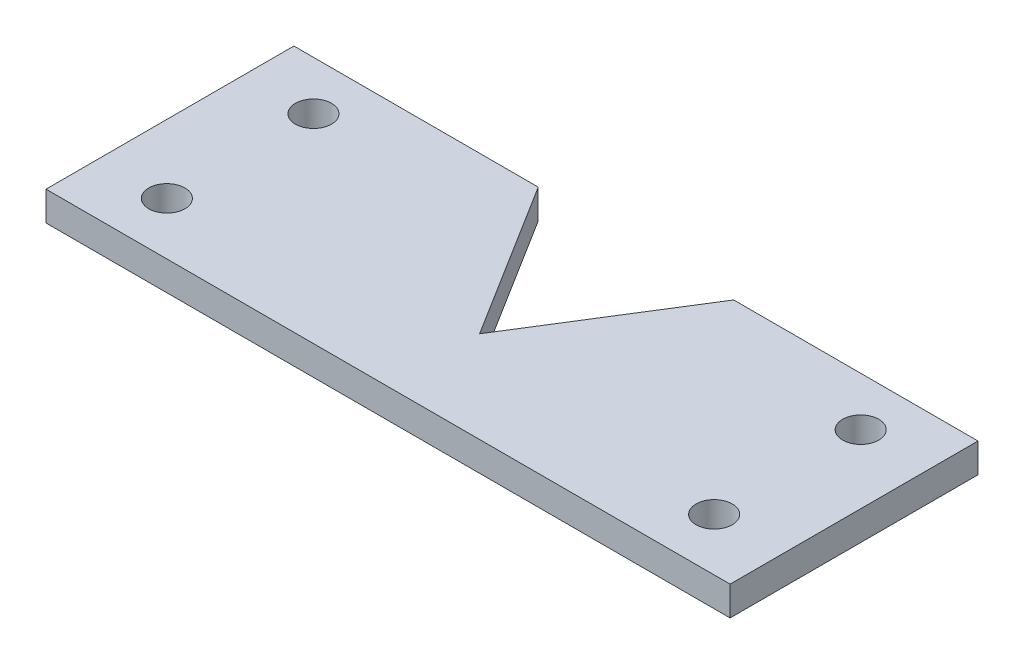
ISO-10303-21;
HEADER;
FILE_DESCRIPTION(('STEP AP214'),'2;1');
FILE_NAME('part.step','',(''),(''),'','','');
FILE_SCHEMA(('AUTOMOTIVE_DESIGN { 1 0 10303 214 1 1 1 1 }'));
ENDSEC;
DATA;
#1=APPLICATION_CONTEXT('core data for automotive mechanical design processes');
#2=APPLICATION_PROTOCOL_DEFINITION('international standard','automotive_design',2000,#1);
#3=PRODUCT_CONTEXT('',#1,'mechanical');
#4=PRODUCT('Part','Part','',(#3));
#5=PRODUCT_RELATED_PRODUCT_CATEGORY('part','',(#4));
#6=PRODUCT_DEFINITION_FORMATION('','',#4);
#7=PRODUCT_DEFINITION_CONTEXT('part definition',#1,'design');
#8=PRODUCT_DEFINITION('design','',#6,#7);
#9=PRODUCT_DEFINITION_SHAPE('','',#8);
#10=(LENGTH_UNIT() NAMED_UNIT(*) SI_UNIT(.MILLI.,.METRE.));
#11=(NAMED_UNIT(*) PLANE_ANGLE_UNIT() SI_UNIT($,.RADIAN.));
#12=(NAMED_UNIT(*) SI_UNIT($,.STERADIAN.) SOLID_ANGLE_UNIT());
#13=UNCERTAINTY_MEASURE_WITH_UNIT(LENGTH_MEASURE(1.E-05),#10,'distance_accuracy_value','');
#14=(GEOMETRIC_REPRESENTATION_CONTEXT(3) GLOBAL_UNCERTAINTY_ASSIGNED_CONTEXT((#13)) GLOBAL_UNIT_ASSIGNED_CONTEXT((#10,
#11,#12)) REPRESENTATION_CONTEXT('',''));
#15=CARTESIAN_POINT('',(0.,0.,0.));
#16=DIRECTION('',(0.,0.,1.));
#17=DIRECTION('',(1.,0.,0.));
#18=AXIS2_PLACEMENT_3D('',#15,#16,#17);
#19=CARTESIAN_POINT('',(0.,0.,0.));
#20=DIRECTION('',(0.,0.,1.));
#21=DIRECTION('',(1.,0.,0.));
#22=AXIS2_PLACEMENT_3D('',#19,#20,#21);
#23=PLANE('',#22);
#24=DIRECTION('',(-1.,0.,0.));
#25=VECTOR('',#24,1.);
#26=CARTESIAN_POINT('',(-15.0721058637928,19.3687471029999,0.));
#27=LINE('',#26,#25);
#28=CARTESIAN_POINT('',(-60.0721058637928,19.3687471029999,0.));
#29=VERTEX_POINT('',#28);
#30=CARTESIAN_POINT('',(-85.0721058637928,19.3687471029999,0.));
#31=VERTEX_POINT('',#30);
#32=EDGE_CURVE('E135',#29,#31,#27,.T.);
#33=ORIENTED_EDGE('',*,*,#32,.F.);
#34=DIRECTION('',(0.,-1.,0.));
#35=VECTOR('',#34,1.);
#36=CARTESIAN_POINT('',(-60.0721058637928,19.3687471029999,0.));
#37=LINE('',#36,#35);
#38=CARTESIAN_POINT('',(-60.0721058637928,16.3687471029999,0.));
#39=VERTEX_POINT('',#38);
#40=EDGE_CURVE('E197',#29,#39,#37,.T.);
#41=ORIENTED_EDGE('',*,*,#40,.T.);
#42=DIRECTION('',(-1.,0.,0.));
#43=VECTOR('',#42,1.);
#44=CARTESIAN_POINT('',(0.,16.3687471029999,0.));
#45=LINE('',#44,#43);
#46=CARTESIAN_POINT('',(-85.0721058637928,16.3687471029999,0.));
#47=VERTEX_POINT('',#46);
#48=EDGE_CURVE('E178',#39,#47,#45,.T.);
#49=ORIENTED_EDGE('',*,*,#48,.T.);
#50=DIRECTION('',(0.,1.,0.));
#51=VECTOR('',#50,1.);
#52=CARTESIAN_POINT('',(-85.0721058637928,0.,0.));
#53=LINE('',#52,#51);
#54=EDGE_CURVE('E58',#47,#31,#53,.T.);
#55=ORIENTED_EDGE('',*,*,#54,.T.);
#56=EDGE_LOOP('',(#33,#41,#49,#55));
#57=FACE_BOUND('',#56,.T.);
#58=ADVANCED_FACE('F49',(#57),#23,.F.);
#59=CARTESIAN_POINT('',(-15.0721058637928,0.,40.));
#60=DIRECTION('',(-1.,0.,0.));
#61=DIRECTION('',(0.,0.,1.));
#62=AXIS2_PLACEMENT_3D('',#59,#60,#61);
#63=PLANE('',#62);
#64=DIRECTION('',(0.,1.,0.));
#65=VECTOR('',#64,1.);
#66=CARTESIAN_POINT('',(-15.0721058637928,14.3687471029999,25.3664991970526));
#67=LINE('',#66,#65);
#68=CARTESIAN_POINT('',(-15.0721058637928,16.3687471029999,25.3664991970526));
#69=VERTEX_POINT('',#68);
#70=CARTESIAN_POINT('',(-15.0721058637928,19.3687471029999,25.3664991970526));
#71=VERTEX_POINT('',#70);
#72=EDGE_CURVE('E163',#69,#71,#67,.T.);
#73=ORIENTED_EDGE('',*,*,#72,.F.);
#74=DIRECTION('',(0.,0.,1.));
#75=VECTOR('',#74,1.);
#76=CARTESIAN_POINT('',(-15.0721058637928,16.3687471029999,-0.633500802947405));
#77=LINE('',#76,#75);
#78=CARTESIAN_POINT('',(-15.0721058637928,16.3687471029999,0.));
#79=VERTEX_POINT('',#78);
#80=EDGE_CURVE('E73',#79,#69,#77,.T.);
#81=ORIENTED_EDGE('',*,*,#80,.F.);
#82=DIRECTION('',(0.,1.,0.));
#83=VECTOR('',#82,1.);
#84=CARTESIAN_POINT('',(-15.0721058637928,0.,0.));
#85=LINE('',#84,#83);
#86=CARTESIAN_POINT('',(-15.0721058637928,19.3687471029999,0.));
#87=VERTEX_POINT('',#86);
#88=EDGE_CURVE('E167',#79,#87,#85,.T.);
#89=ORIENTED_EDGE('',*,*,#88,.T.);
#90=DIRECTION('',(0.,0.,-1.));
#91=VECTOR('',#90,1.);
#92=CARTESIAN_POINT('',(-15.0721058637928,19.3687471029999,26.));
#93=LINE('',#92,#91);
#94=EDGE_CURVE('E133',#71,#87,#93,.T.);
#95=ORIENTED_EDGE('',*,*,#94,.F.);
#96=EDGE_LOOP('',(#73,#81,#89,#95));
#97=FACE_BOUND('',#96,.T.);
#98=ADVANCED_FACE('F51',(#97),#63,.F.);
#99=CARTESIAN_POINT('',(-85.0721058637928,0.,40.));
#100=DIRECTION('',(-1.,0.,0.));
#101=DIRECTION('',(0.,0.,1.));
#102=AXIS2_PLACEMENT_3D('',#99,#100,#101);
#103=PLANE('',#102);
#104=DIRECTION('',(0.,0.,1.));
#105=VECTOR('',#104,1.);
#106=CARTESIAN_POINT('',(-85.0721058637928,16.3687471029999,-0.633500802947405));
#107=LINE('',#106,#105);
#108=CARTESIAN_POINT('',(-85.0721058637928,16.3687471029999,25.3664991970526));
#109=VERTEX_POINT('',#108);
#110=EDGE_CURVE('E191',#47,#109,#107,.T.);
#111=ORIENTED_EDGE('',*,*,#110,.T.);
#112=DIRECTION('',(0.,1.,0.));
#113=VECTOR('',#112,1.);
#114=CARTESIAN_POINT('',(-85.0721058637928,14.3687471029999,25.3664991970526));
#115=LINE('',#114,#113);
#116=CARTESIAN_POINT('',(-85.0721058637928,19.3687471029999,25.3664991970526));
#117=VERTEX_POINT('',#116);
#118=EDGE_CURVE('E164',#109,#117,#115,.T.);
#119=ORIENTED_EDGE('',*,*,#118,.T.);
#120=DIRECTION('',(0.,0.,-1.));
#121=VECTOR('',#120,1.);
#122=CARTESIAN_POINT('',(-85.0721058637928,19.3687471029999,26.));
#123=LINE('',#122,#121);
#124=EDGE_CURVE('E139',#117,#31,#123,.T.);
#125=ORIENTED_EDGE('',*,*,#124,.T.);
#126=ORIENTED_EDGE('',*,*,#54,.F.);
#127=EDGE_LOOP('',(#111,#119,#125,#126));
#128=FACE_BOUND('',#127,.T.);
#129=ADVANCED_FACE('F183',(#128),#103,.T.);
#130=CARTESIAN_POINT('',(-40.0721058637928,16.3687471029999,0.));
#131=VERTEX_POINT('',#130);
#132=EDGE_CURVE('E125',#79,#131,#45,.T.);
#133=ORIENTED_EDGE('',*,*,#132,.T.);
#134=DIRECTION('',(0.,-1.,0.));
#135=VECTOR('',#134,1.);
#136=CARTESIAN_POINT('',(-40.0721058637928,19.3687471029999,0.));
#137=LINE('',#136,#135);
#138=CARTESIAN_POINT('',(-40.0721058637928,19.3687471029999,0.));
#139=VERTEX_POINT('',#138);
#140=EDGE_CURVE('E65',#139,#131,#137,.T.);
#141=ORIENTED_EDGE('',*,*,#140,.F.);
#142=EDGE_CURVE('E124',#87,#139,#27,.T.);
#143=ORIENTED_EDGE('',*,*,#142,.F.);
#144=ORIENTED_EDGE('',*,*,#88,.F.);
#145=EDGE_LOOP('',(#133,#141,#143,#144));
#146=FACE_BOUND('',#145,.T.);
#147=ADVANCED_FACE('F122',(#146),#23,.F.);
#148=CARTESIAN_POINT('',(-22.0721058637928,34.3687471029999,5.));
#149=DIRECTION('',(0.,1.,0.));
#150=DIRECTION('',(0.,0.,1.));
#151=AXIS2_PLACEMENT_3D('',#148,#149,#150);
#152=CYLINDRICAL_SURFACE('',#151,1.85);
#153=CARTESIAN_POINT('',(-22.0721058637928,16.3687471029999,5.));
#154=DIRECTION('',(0.,1.,0.));
#155=DIRECTION('',(0.,0.,1.));
#156=AXIS2_PLACEMENT_3D('',#153,#154,#155);
#157=CIRCLE('',#156,1.85);
#158=CARTESIAN_POINT('',(-22.0721058637928,16.3687471029999,6.84999999999999));
#159=VERTEX_POINT('',#158);
#160=EDGE_CURVE('E210',#159,#159,#157,.F.);
#161=ORIENTED_EDGE('',*,*,#160,.T.);
#162=EDGE_LOOP('',(#161));
#163=FACE_BOUND('',#162,.T.);
#164=CARTESIAN_POINT('',(-22.0721058637928,19.3687471029999,5.));
#165=DIRECTION('',(0.,-1.,0.));
#166=DIRECTION('',(0.,0.,-1.));
#167=AXIS2_PLACEMENT_3D('',#164,#165,#166);
#168=CIRCLE('',#167,1.85);
#169=CARTESIAN_POINT('',(-22.0721058637928,19.3687471029999,3.15));
#170=VERTEX_POINT('',#169);
#171=EDGE_CURVE('E159',#170,#170,#168,.F.);
#172=ORIENTED_EDGE('',*,*,#171,.T.);
#173=EDGE_LOOP('',(#172));
#174=FACE_BOUND('',#173,.T.);
#175=ADVANCED_FACE('F217',(#163,#174),#152,.F.);
#176=CARTESIAN_POINT('',(-22.0721058637928,34.3687471029999,20.));
#177=DIRECTION('',(0.,1.,0.));
#178=DIRECTION('',(0.,0.,1.));
#179=AXIS2_PLACEMENT_3D('',#176,#177,#178);
#180=CYLINDRICAL_SURFACE('',#179,1.85);
#181=CARTESIAN_POINT('',(-22.0721058637928,16.3687471029999,20.));
#182=DIRECTION('',(0.,1.,0.));
#183=DIRECTION('',(0.,0.,1.));
#184=AXIS2_PLACEMENT_3D('',#181,#182,#183);
#185=CIRCLE('',#184,1.85);
#186=CARTESIAN_POINT('',(-22.0721058637928,16.3687471029999,21.85));
#187=VERTEX_POINT('',#186);
#188=EDGE_CURVE('E207',#187,#187,#185,.F.);
#189=ORIENTED_EDGE('',*,*,#188,.T.);
#190=EDGE_LOOP('',(#189));
#191=FACE_BOUND('',#190,.T.);
#192=CARTESIAN_POINT('',(-22.0721058637928,19.3687471029999,20.));
#193=DIRECTION('',(0.,-1.,0.));
#194=DIRECTION('',(0.,0.,-1.));
#195=AXIS2_PLACEMENT_3D('',#192,#193,#194);
#196=CIRCLE('',#195,1.85);
#197=CARTESIAN_POINT('',(-22.0721058637928,19.3687471029999,18.15));
#198=VERTEX_POINT('',#197);
#199=EDGE_CURVE('E155',#198,#198,#196,.F.);
#200=ORIENTED_EDGE('',*,*,#199,.T.);
#201=EDGE_LOOP('',(#200));
#202=FACE_BOUND('',#201,.T.);
#203=ADVANCED_FACE('F256',(#191,#202),#180,.F.);
#204=CARTESIAN_POINT('',(-78.0721058637928,34.3687471029999,20.));
#205=DIRECTION('',(0.,1.,0.));
#206=DIRECTION('',(0.,0.,1.));
#207=AXIS2_PLACEMENT_3D('',#204,#205,#206);
#208=CYLINDRICAL_SURFACE('',#207,1.84999999999999);
#209=CARTESIAN_POINT('',(-78.0721058637928,16.3687471029999,20.));
#210=DIRECTION('',(0.,1.,0.));
#211=DIRECTION('',(0.,0.,1.));
#212=AXIS2_PLACEMENT_3D('',#209,#210,#211);
#213=CIRCLE('',#212,1.84999999999999);
#214=CARTESIAN_POINT('',(-78.0721058637928,16.3687471029999,21.85));
#215=VERTEX_POINT('',#214);
#216=EDGE_CURVE('E203',#215,#215,#213,.F.);
#217=ORIENTED_EDGE('',*,*,#216,.T.);
#218=EDGE_LOOP('',(#217));
#219=FACE_BOUND('',#218,.T.);
#220=CARTESIAN_POINT('',(-78.0721058637928,19.3687471029999,20.));
#221=DIRECTION('',(0.,-1.,0.));
#222=DIRECTION('',(0.,0.,-1.));
#223=AXIS2_PLACEMENT_3D('',#220,#221,#222);
#224=CIRCLE('',#223,1.84999999999999);
#225=CARTESIAN_POINT('',(-78.0721058637928,19.3687471029999,18.15));
#226=VERTEX_POINT('',#225);
#227=EDGE_CURVE('E151',#226,#226,#224,.F.);
#228=ORIENTED_EDGE('',*,*,#227,.T.);
#229=EDGE_LOOP('',(#228));
#230=FACE_BOUND('',#229,.T.);
#231=ADVANCED_FACE('F275',(#219,#230),#208,.F.);
#232=CARTESIAN_POINT('',(-78.0721058637928,34.3687471029999,5.));
#233=DIRECTION('',(0.,1.,0.));
#234=DIRECTION('',(0.,0.,1.));
#235=AXIS2_PLACEMENT_3D('',#232,#233,#234);
#236=CYLINDRICAL_SURFACE('',#235,1.84999999999999);
#237=CARTESIAN_POINT('',(-78.0721058637928,16.3687471029999,5.));
#238=DIRECTION('',(0.,1.,0.));
#239=DIRECTION('',(0.,0.,1.));
#240=AXIS2_PLACEMENT_3D('',#237,#238,#239);
#241=CIRCLE('',#240,1.84999999999999);
#242=CARTESIAN_POINT('',(-78.0721058637928,16.3687471029999,6.84999999999999));
#243=VERTEX_POINT('',#242);
#244=EDGE_CURVE('E195',#243,#243,#241,.F.);
#245=ORIENTED_EDGE('',*,*,#244,.T.);
#246=EDGE_LOOP('',(#245));
#247=FACE_BOUND('',#246,.T.);
#248=CARTESIAN_POINT('',(-78.0721058637928,19.3687471029999,5.));
#249=DIRECTION('',(0.,-1.,0.));
#250=DIRECTION('',(0.,0.,-1.));
#251=AXIS2_PLACEMENT_3D('',#248,#249,#250);
#252=CIRCLE('',#251,1.84999999999999);
#253=CARTESIAN_POINT('',(-78.0721058637928,19.3687471029999,3.15000000000001));
#254=VERTEX_POINT('',#253);
#255=EDGE_CURVE('E146',#254,#254,#252,.F.);
#256=ORIENTED_EDGE('',*,*,#255,.T.);
#257=EDGE_LOOP('',(#256));
#258=FACE_BOUND('',#257,.T.);
#259=ADVANCED_FACE('F284',(#247,#258),#236,.F.);
#260=CARTESIAN_POINT('',(-85.0721058637928,14.3687471029999,25.3664991970526));
#261=DIRECTION('',(0.,0.,-1.));
#262=DIRECTION('',(-1.,0.,0.));
#263=AXIS2_PLACEMENT_3D('',#260,#261,#262);
#264=PLANE('',#263);
#265=ORIENTED_EDGE('',*,*,#118,.F.);
#266=DIRECTION('',(-1.,0.,0.));
#267=VECTOR('',#266,1.);
#268=CARTESIAN_POINT('',(-85.0721058637928,16.3687471029999,25.3664991970526));
#269=LINE('',#268,#267);
#270=EDGE_CURVE('E188',#69,#109,#269,.T.);
#271=ORIENTED_EDGE('',*,*,#270,.F.);
#272=ORIENTED_EDGE('',*,*,#72,.T.);
#273=DIRECTION('',(-1.,0.,0.));
#274=VECTOR('',#273,1.);
#275=CARTESIAN_POINT('',(-85.0721058637928,19.3687471029999,25.3664991970526));
#276=LINE('',#275,#274);
#277=EDGE_CURVE('E11',#71,#117,#276,.T.);
#278=ORIENTED_EDGE('',*,*,#277,.T.);
#279=EDGE_LOOP('',(#265,#271,#272,#278));
#280=FACE_BOUND('',#279,.T.);
#281=ADVANCED_FACE('F186',(#280),#264,.F.);
#282=CARTESIAN_POINT('',(-15.0721058637928,19.3687471029999,26.));
#283=DIRECTION('',(0.,-1.,0.));
#284=DIRECTION('',(0.,0.,-1.));
#285=AXIS2_PLACEMENT_3D('',#282,#283,#284);
#286=PLANE('',#285);
#287=ORIENTED_EDGE('',*,*,#199,.F.);
#288=EDGE_LOOP('',(#287));
#289=FACE_BOUND('',#288,.T.);
#290=ORIENTED_EDGE('',*,*,#255,.F.);
#291=EDGE_LOOP('',(#290));
#292=FACE_BOUND('',#291,.T.);
#293=DIRECTION('',(-0.52999894000318,0.,0.847998304005088));
#294=VECTOR('',#293,1.);
#295=CARTESIAN_POINT('',(-40.0721058637928,19.3687471029999,0.));
#296=LINE('',#295,#294);
#297=CARTESIAN_POINT('',(-50.0721058637928,19.3687471029999,16.));
#298=VERTEX_POINT('',#297);
#299=EDGE_CURVE('E108',#139,#298,#296,.T.);
#300=ORIENTED_EDGE('',*,*,#299,.T.);
#301=DIRECTION('',(-0.52999894000318,0.,-0.847998304005088));
#302=VECTOR('',#301,1.);
#303=CARTESIAN_POINT('',(-50.0721058637928,19.3687471029999,16.));
#304=LINE('',#303,#302);
#305=EDGE_CURVE('E116',#298,#29,#304,.T.);
#306=ORIENTED_EDGE('',*,*,#305,.T.);
#307=ORIENTED_EDGE('',*,*,#32,.T.);
#308=ORIENTED_EDGE('',*,*,#124,.F.);
#309=ORIENTED_EDGE('',*,*,#277,.F.);
#310=ORIENTED_EDGE('',*,*,#94,.T.);
#311=ORIENTED_EDGE('',*,*,#142,.T.);
#312=EDGE_LOOP('',(#300,#306,#307,#308,#309,#310,#311));
#313=FACE_BOUND('',#312,.T.);
#314=ORIENTED_EDGE('',*,*,#227,.F.);
#315=EDGE_LOOP('',(#314));
#316=FACE_BOUND('',#315,.T.);
#317=ORIENTED_EDGE('',*,*,#171,.F.);
#318=EDGE_LOOP('',(#317));
#319=FACE_BOUND('',#318,.T.);
#320=ADVANCED_FACE('F129',(#289,#292,#313,#316,#319),#286,.F.);
#321=CARTESIAN_POINT('',(-85.0721058637928,16.3687471029999,-0.633500802947405));
#322=DIRECTION('',(0.,1.,0.));
#323=DIRECTION('',(0.,0.,1.));
#324=AXIS2_PLACEMENT_3D('',#321,#322,#323);
#325=PLANE('',#324);
#326=ORIENTED_EDGE('',*,*,#188,.F.);
#327=EDGE_LOOP('',(#326));
#328=FACE_BOUND('',#327,.T.);
#329=ORIENTED_EDGE('',*,*,#244,.F.);
#330=EDGE_LOOP('',(#329));
#331=FACE_BOUND('',#330,.T.);
#332=ORIENTED_EDGE('',*,*,#216,.F.);
#333=EDGE_LOOP('',(#332));
#334=FACE_BOUND('',#333,.T.);
#335=ORIENTED_EDGE('',*,*,#160,.F.);
#336=EDGE_LOOP('',(#335));
#337=FACE_BOUND('',#336,.T.);
#338=ORIENTED_EDGE('',*,*,#48,.F.);
#339=DIRECTION('',(-0.52999894000318,0.,-0.847998304005088));
#340=VECTOR('',#339,1.);
#341=CARTESIAN_POINT('',(-50.0721058637928,16.3687471029999,16.));
#342=LINE('',#341,#340);
#343=CARTESIAN_POINT('',(-50.0721058637928,16.3687471029999,16.));
#344=VERTEX_POINT('',#343);
#345=EDGE_CURVE('E117',#344,#39,#342,.T.);
#346=ORIENTED_EDGE('',*,*,#345,.F.);
#347=DIRECTION('',(-0.52999894000318,0.,0.847998304005088));
#348=VECTOR('',#347,1.);
#349=CARTESIAN_POINT('',(-40.0721058637928,16.3687471029999,0.));
#350=LINE('',#349,#348);
#351=EDGE_CURVE('E226',#131,#344,#350,.T.);
#352=ORIENTED_EDGE('',*,*,#351,.F.);
#353=ORIENTED_EDGE('',*,*,#132,.F.);
#354=ORIENTED_EDGE('',*,*,#80,.T.);
#355=ORIENTED_EDGE('',*,*,#270,.T.);
#356=ORIENTED_EDGE('',*,*,#110,.F.);
#357=EDGE_LOOP('',(#338,#346,#352,#353,#354,#355,#356));
#358=FACE_BOUND('',#357,.T.);
#359=ADVANCED_FACE('F220',(#328,#331,#334,#337,#358),#325,.F.);
#360=CARTESIAN_POINT('',(-50.0721058637928,19.3687471029999,16.));
#361=DIRECTION('',(-0.847998304005088,0.,0.52999894000318));
#362=DIRECTION('',(0.52999894000318,0.,0.847998304005088));
#363=AXIS2_PLACEMENT_3D('',#360,#361,#362);
#364=PLANE('',#363);
#365=ORIENTED_EDGE('',*,*,#345,.T.);
#366=ORIENTED_EDGE('',*,*,#40,.F.);
#367=ORIENTED_EDGE('',*,*,#305,.F.);
#368=DIRECTION('',(0.,-1.,0.));
#369=VECTOR('',#368,1.);
#370=CARTESIAN_POINT('',(-50.0721058637928,19.3687471029999,16.));
#371=LINE('',#370,#369);
#372=EDGE_CURVE('E110',#298,#344,#371,.T.);
#373=ORIENTED_EDGE('',*,*,#372,.T.);
#374=EDGE_LOOP('',(#365,#366,#367,#373));
#375=FACE_BOUND('',#374,.T.);
#376=ADVANCED_FACE('F222',(#375),#364,.F.);
#377=CARTESIAN_POINT('',(-40.0721058637928,19.3687471029999,0.));
#378=DIRECTION('',(0.847998304005088,0.,0.52999894000318));
#379=DIRECTION('',(0.52999894000318,0.,-0.847998304005088));
#380=AXIS2_PLACEMENT_3D('',#377,#378,#379);
#381=PLANE('',#380);
#382=ORIENTED_EDGE('',*,*,#351,.T.);
#383=ORIENTED_EDGE('',*,*,#372,.F.);
#384=ORIENTED_EDGE('',*,*,#299,.F.);
#385=ORIENTED_EDGE('',*,*,#140,.T.);
#386=EDGE_LOOP('',(#382,#383,#384,#385));
#387=FACE_BOUND('',#386,.T.);
#388=ADVANCED_FACE('F109',(#387),#381,.F.);
#389=CLOSED_SHELL('',(#58,#98,#129,#147,#175,#203,#231,#259,#281,#320,#359,#376,#388));
#390=MANIFOLD_SOLID_BREP('B2',#389);
#391=ADVANCED_BREP_SHAPE_REPRESENTATION('',(#18,#390),#14);
#392=SHAPE_DEFINITION_REPRESENTATION(#9,#391);
ENDSEC;
END-ISO-10303-21;
